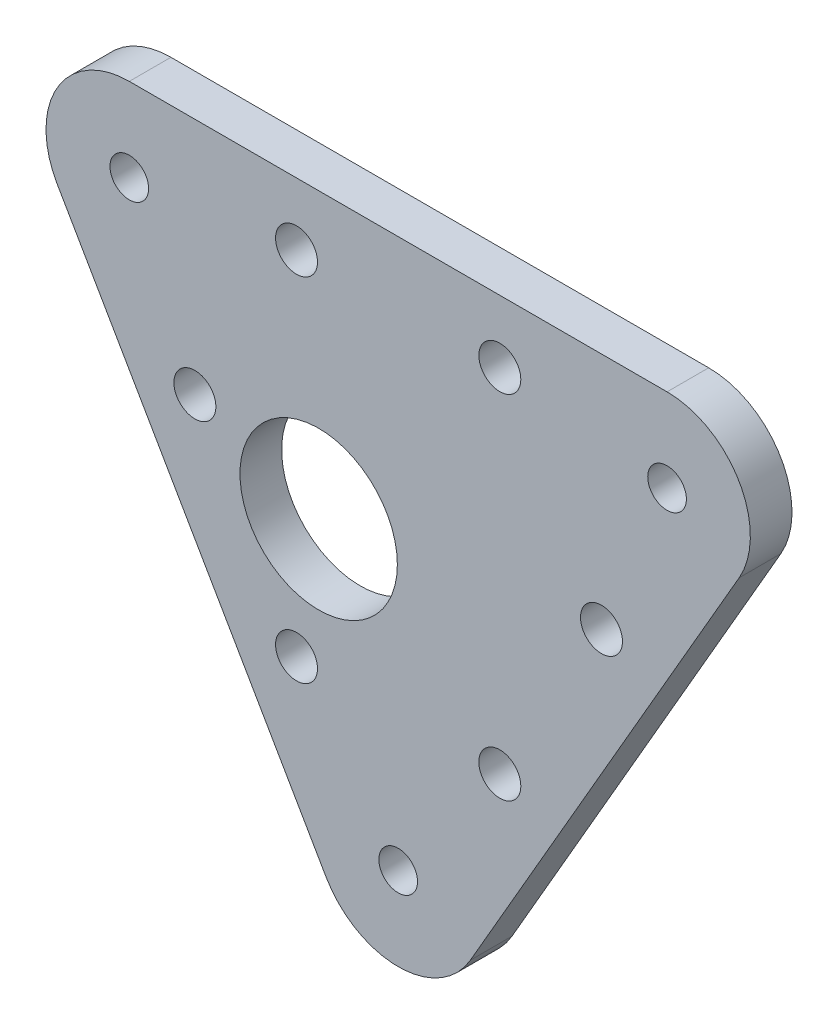
ISO-10303-21;
HEADER;
FILE_DESCRIPTION(('STEP AP214'),'2;1');
FILE_NAME('part.step','',(''),(''),'','','');
FILE_SCHEMA(('AUTOMOTIVE_DESIGN { 1 0 10303 214 1 1 1 1 }'));
ENDSEC;
DATA;
#1=APPLICATION_CONTEXT('core data for automotive mechanical design processes');
#2=APPLICATION_PROTOCOL_DEFINITION('international standard','automotive_design',2000,#1);
#3=PRODUCT_CONTEXT('',#1,'mechanical');
#4=PRODUCT('Part','Part','',(#3));
#5=PRODUCT_RELATED_PRODUCT_CATEGORY('part','',(#4));
#6=PRODUCT_DEFINITION_FORMATION('','',#4);
#7=PRODUCT_DEFINITION_CONTEXT('part definition',#1,'design');
#8=PRODUCT_DEFINITION('design','',#6,#7);
#9=PRODUCT_DEFINITION_SHAPE('','',#8);
#10=(LENGTH_UNIT() NAMED_UNIT(*) SI_UNIT(.MILLI.,.METRE.));
#11=(NAMED_UNIT(*) PLANE_ANGLE_UNIT() SI_UNIT($,.RADIAN.));
#12=(NAMED_UNIT(*) SI_UNIT($,.STERADIAN.) SOLID_ANGLE_UNIT());
#13=UNCERTAINTY_MEASURE_WITH_UNIT(LENGTH_MEASURE(1.E-05),#10,'distance_accuracy_value','');
#14=(GEOMETRIC_REPRESENTATION_CONTEXT(3) GLOBAL_UNCERTAINTY_ASSIGNED_CONTEXT((#13)) GLOBAL_UNIT_ASSIGNED_CONTEXT((#10,
#11,#12)) REPRESENTATION_CONTEXT('',''));
#15=CARTESIAN_POINT('',(0.,0.,0.));
#16=DIRECTION('',(0.,0.,1.));
#17=DIRECTION('',(1.,0.,0.));
#18=AXIS2_PLACEMENT_3D('',#15,#16,#17);
#19=CARTESIAN_POINT('',(31.4988919710468,18.1858937586588,-3.175));
#20=DIRECTION('',(0.,0.,1.));
#21=DIRECTION('',(-1.,0.,0.));
#22=AXIS2_PLACEMENT_3D('',#19,#20,#21);
#23=PLANE('',#22);
#24=CARTESIAN_POINT('',(-20.5003693429844,11.8358937586588,-3.175));
#25=DIRECTION('',(0.,0.,1.));
#26=DIRECTION('',(1.,0.,0.));
#27=AXIS2_PLACEMENT_3D('',#24,#25,#26);
#28=CIRCLE('',#27,1.47319999999999);
#29=CARTESIAN_POINT('',(-19.0271693429844,11.8358937586588,-3.175));
#30=VERTEX_POINT('',#29);
#31=EDGE_CURVE('E150',#30,#30,#28,.T.);
#32=ORIENTED_EDGE('',*,*,#31,.T.);
#33=EDGE_LOOP('',(#32));
#34=FACE_BOUND('',#33,.T.);
#35=CARTESIAN_POINT('',(20.5003693429844,11.8358937586588,-3.175));
#36=DIRECTION('',(0.,0.,1.));
#37=DIRECTION('',(1.,0.,0.));
#38=AXIS2_PLACEMENT_3D('',#35,#36,#37);
#39=CIRCLE('',#38,1.47319999999999);
#40=CARTESIAN_POINT('',(21.9735693429844,11.8358937586588,-3.175));
#41=VERTEX_POINT('',#40);
#42=EDGE_CURVE('E140',#41,#41,#39,.T.);
#43=ORIENTED_EDGE('',*,*,#42,.T.);
#44=EDGE_LOOP('',(#43));
#45=FACE_BOUND('',#44,.T.);
#46=CARTESIAN_POINT('',(-1.70002900645727E-13,-23.6717875173176,-3.175));
#47=DIRECTION('',(0.,0.,1.));
#48=DIRECTION('',(1.,0.,0.));
#49=AXIS2_PLACEMENT_3D('',#46,#47,#48);
#50=CIRCLE('',#49,1.47319999999999);
#51=CARTESIAN_POINT('',(1.47319999999982,-23.6717875173176,-3.175));
#52=VERTEX_POINT('',#51);
#53=EDGE_CURVE('E137',#52,#52,#50,.T.);
#54=ORIENTED_EDGE('',*,*,#53,.T.);
#55=EDGE_LOOP('',(#54));
#56=FACE_BOUND('',#55,.T.);
#57=CARTESIAN_POINT('',(-7.74999999999992,13.4233937586588,-3.175));
#58=DIRECTION('',(0.,0.,1.));
#59=DIRECTION('',(1.,0.,0.));
#60=AXIS2_PLACEMENT_3D('',#57,#58,#59);
#61=CIRCLE('',#60,1.59999999999999);
#62=CARTESIAN_POINT('',(-6.14999999999993,13.4233937586588,-3.175));
#63=VERTEX_POINT('',#62);
#64=EDGE_CURVE('E136',#63,#63,#61,.T.);
#65=ORIENTED_EDGE('',*,*,#64,.T.);
#66=EDGE_LOOP('',(#65));
#67=FACE_BOUND('',#66,.T.);
#68=CARTESIAN_POINT('',(7.75000000000008,13.4233937586588,-3.175));
#69=DIRECTION('',(0.,0.,1.));
#70=DIRECTION('',(1.,0.,0.));
#71=AXIS2_PLACEMENT_3D('',#68,#69,#70);
#72=CIRCLE('',#71,1.59999999999999);
#73=CARTESIAN_POINT('',(9.35000000000007,13.4233937586588,-3.175));
#74=VERTEX_POINT('',#73);
#75=EDGE_CURVE('E158',#74,#74,#72,.T.);
#76=ORIENTED_EDGE('',*,*,#75,.T.);
#77=EDGE_LOOP('',(#76));
#78=FACE_BOUND('',#77,.T.);
#79=CARTESIAN_POINT('',(15.5,0.,-3.175));
#80=DIRECTION('',(0.,0.,1.));
#81=DIRECTION('',(1.,0.,0.));
#82=AXIS2_PLACEMENT_3D('',#79,#80,#81);
#83=CIRCLE('',#82,1.59999999999999);
#84=CARTESIAN_POINT('',(17.1,0.,-3.175));
#85=VERTEX_POINT('',#84);
#86=EDGE_CURVE('E164',#85,#85,#83,.T.);
#87=ORIENTED_EDGE('',*,*,#86,.T.);
#88=EDGE_LOOP('',(#87));
#89=FACE_BOUND('',#88,.T.);
#90=CARTESIAN_POINT('',(-15.5,0.,-3.175));
#91=DIRECTION('',(0.,0.,1.));
#92=DIRECTION('',(1.,0.,0.));
#93=AXIS2_PLACEMENT_3D('',#90,#91,#92);
#94=CIRCLE('',#93,1.59999999999999);
#95=CARTESIAN_POINT('',(-13.9,0.,-3.175));
#96=VERTEX_POINT('',#95);
#97=EDGE_CURVE('E170',#96,#96,#94,.T.);
#98=ORIENTED_EDGE('',*,*,#97,.T.);
#99=EDGE_LOOP('',(#98));
#100=FACE_BOUND('',#99,.T.);
#101=CARTESIAN_POINT('',(-7.75000000000008,-13.4233937586588,-3.175));
#102=DIRECTION('',(0.,0.,1.));
#103=DIRECTION('',(1.,0.,0.));
#104=AXIS2_PLACEMENT_3D('',#101,#102,#103);
#105=CIRCLE('',#104,1.59999999999999);
#106=CARTESIAN_POINT('',(-6.1500000000001,-13.4233937586588,-3.175));
#107=VERTEX_POINT('',#106);
#108=EDGE_CURVE('E176',#107,#107,#105,.T.);
#109=ORIENTED_EDGE('',*,*,#108,.T.);
#110=EDGE_LOOP('',(#109));
#111=FACE_BOUND('',#110,.T.);
#112=CARTESIAN_POINT('',(7.74999999999992,-13.4233937586588,-3.175));
#113=DIRECTION('',(0.,0.,1.));
#114=DIRECTION('',(1.,0.,0.));
#115=AXIS2_PLACEMENT_3D('',#112,#113,#114);
#116=CIRCLE('',#115,1.59999999999999);
#117=CARTESIAN_POINT('',(9.34999999999991,-13.4233937586588,-3.175));
#118=VERTEX_POINT('',#117);
#119=EDGE_CURVE('E182',#118,#118,#116,.T.);
#120=ORIENTED_EDGE('',*,*,#119,.T.);
#121=EDGE_LOOP('',(#120));
#122=FACE_BOUND('',#121,.T.);
#123=DIRECTION('',(0.499999999999997,-0.86602540378444,0.));
#124=VECTOR('',#123,1.);
#125=CARTESIAN_POINT('',(-31.4988919710467,18.1858937586588,-3.175));
#126=LINE('',#125,#124);
#127=CARTESIAN_POINT('',(-25.9996306570156,8.66089375865878,-3.175));
#128=VERTEX_POINT('',#127);
#129=CARTESIAN_POINT('',(-5.49926131403138,-26.8467875173176,-3.175));
#130=VERTEX_POINT('',#129);
#131=EDGE_CURVE('E115',#128,#130,#126,.T.);
#132=ORIENTED_EDGE('',*,*,#131,.F.);
#133=CARTESIAN_POINT('',(-20.5003693429844,11.8358937586588,-3.175));
#134=DIRECTION('',(0.,0.,-1.));
#135=DIRECTION('',(-1.,0.,0.));
#136=AXIS2_PLACEMENT_3D('',#133,#134,#135);
#137=CIRCLE('',#136,6.35);
#138=CARTESIAN_POINT('',(-20.5003693429844,18.1858937586588,-3.175));
#139=VERTEX_POINT('',#138);
#140=EDGE_CURVE('E128',#139,#128,#137,.F.);
#141=ORIENTED_EDGE('',*,*,#140,.F.);
#142=DIRECTION('',(-1.,0.,0.));
#143=VECTOR('',#142,1.);
#144=CARTESIAN_POINT('',(-31.4988919710467,18.1858937586588,-3.175));
#145=LINE('',#144,#143);
#146=CARTESIAN_POINT('',(20.5003693429844,18.1858937586588,-3.175));
#147=VERTEX_POINT('',#146);
#148=EDGE_CURVE('E113',#147,#139,#145,.T.);
#149=ORIENTED_EDGE('',*,*,#148,.F.);
#150=CARTESIAN_POINT('',(20.5003693429844,11.8358937586588,-3.175));
#151=DIRECTION('',(0.,0.,-1.));
#152=DIRECTION('',(-1.,0.,0.));
#153=AXIS2_PLACEMENT_3D('',#150,#151,#152);
#154=CIRCLE('',#153,6.35);
#155=CARTESIAN_POINT('',(25.9996306570155,8.66089375865874,-3.175));
#156=VERTEX_POINT('',#155);
#157=EDGE_CURVE('E130',#156,#147,#154,.F.);
#158=ORIENTED_EDGE('',*,*,#157,.F.);
#159=DIRECTION('',(0.500000000000003,0.866025403784437,0.));
#160=VECTOR('',#159,1.);
#161=CARTESIAN_POINT('',(31.4988919710468,18.1858937586588,-3.175));
#162=LINE('',#161,#160);
#163=CARTESIAN_POINT('',(5.49926131403101,-26.8467875173176,-3.175));
#164=VERTEX_POINT('',#163);
#165=EDGE_CURVE('E121',#164,#156,#162,.T.);
#166=ORIENTED_EDGE('',*,*,#165,.F.);
#167=CARTESIAN_POINT('',(-1.70002900645727E-13,-23.6717875173176,-3.175));
#168=DIRECTION('',(0.,0.,-1.));
#169=DIRECTION('',(-1.,0.,0.));
#170=AXIS2_PLACEMENT_3D('',#167,#168,#169);
#171=CIRCLE('',#170,6.35);
#172=EDGE_CURVE('E91',#130,#164,#171,.F.);
#173=ORIENTED_EDGE('',*,*,#172,.F.);
#174=EDGE_LOOP('',(#132,#141,#149,#158,#166,#173));
#175=FACE_BOUND('',#174,.T.);
#176=CARTESIAN_POINT('',(-6.06217782649109,-3.49999999999996,-3.175));
#177=DIRECTION('',(0.,0.,1.));
#178=DIRECTION('',(1.,0.,0.));
#179=AXIS2_PLACEMENT_3D('',#176,#177,#178);
#180=CIRCLE('',#179,6.);
#181=CARTESIAN_POINT('',(-0.0621778264910892,-3.49999999999996,-3.175));
#182=VERTEX_POINT('',#181);
#183=EDGE_CURVE('E189',#182,#182,#180,.T.);
#184=ORIENTED_EDGE('',*,*,#183,.T.);
#185=EDGE_LOOP('',(#184));
#186=FACE_BOUND('',#185,.T.);
#187=ADVANCED_FACE('F32',(#34,#45,#56,#67,#78,#89,#100,#111,#122,#175,#186),#23,.F.);
#188=CARTESIAN_POINT('',(31.4988919710468,18.1858937586588,0.));
#189=DIRECTION('',(0.,0.,1.));
#190=DIRECTION('',(-1.,0.,0.));
#191=AXIS2_PLACEMENT_3D('',#188,#189,#190);
#192=PLANE('',#191);
#193=CARTESIAN_POINT('',(-20.5003693429844,11.8358937586588,0.));
#194=DIRECTION('',(0.,0.,-1.));
#195=DIRECTION('',(-1.,0.,0.));
#196=AXIS2_PLACEMENT_3D('',#193,#194,#195);
#197=CIRCLE('',#196,1.47319999999999);
#198=CARTESIAN_POINT('',(-21.9735693429844,11.8358937586588,0.));
#199=VERTEX_POINT('',#198);
#200=EDGE_CURVE('E36',#199,#199,#197,.T.);
#201=ORIENTED_EDGE('',*,*,#200,.T.);
#202=EDGE_LOOP('',(#201));
#203=FACE_BOUND('',#202,.T.);
#204=CARTESIAN_POINT('',(20.5003693429844,11.8358937586588,0.));
#205=DIRECTION('',(0.,0.,-1.));
#206=DIRECTION('',(-1.,0.,0.));
#207=AXIS2_PLACEMENT_3D('',#204,#205,#206);
#208=CIRCLE('',#207,1.47319999999999);
#209=CARTESIAN_POINT('',(19.0271693429844,11.8358937586588,0.));
#210=VERTEX_POINT('',#209);
#211=EDGE_CURVE('E138',#210,#210,#208,.T.);
#212=ORIENTED_EDGE('',*,*,#211,.T.);
#213=EDGE_LOOP('',(#212));
#214=FACE_BOUND('',#213,.T.);
#215=CARTESIAN_POINT('',(-1.70002900645727E-13,-23.6717875173176,0.));
#216=DIRECTION('',(0.,0.,-1.));
#217=DIRECTION('',(-1.,0.,0.));
#218=AXIS2_PLACEMENT_3D('',#215,#216,#217);
#219=CIRCLE('',#218,1.47319999999999);
#220=CARTESIAN_POINT('',(-1.47320000000016,-23.6717875173176,0.));
#221=VERTEX_POINT('',#220);
#222=EDGE_CURVE('E134',#221,#221,#219,.T.);
#223=ORIENTED_EDGE('',*,*,#222,.T.);
#224=EDGE_LOOP('',(#223));
#225=FACE_BOUND('',#224,.T.);
#226=CARTESIAN_POINT('',(-7.74999999999992,13.4233937586588,-1.18221404887819E-12));
#227=DIRECTION('',(0.,0.,1.));
#228=DIRECTION('',(1.,0.,0.));
#229=AXIS2_PLACEMENT_3D('',#226,#227,#228);
#230=CIRCLE('',#229,1.6);
#231=CARTESIAN_POINT('',(-6.14999999999992,13.4233937586588,-1.18221404887819E-12));
#232=VERTEX_POINT('',#231);
#233=EDGE_CURVE('E155',#232,#232,#230,.T.);
#234=ORIENTED_EDGE('',*,*,#233,.F.);
#235=EDGE_LOOP('',(#234));
#236=FACE_BOUND('',#235,.T.);
#237=CARTESIAN_POINT('',(7.75000000000008,13.4233937586588,-1.18221404887819E-12));
#238=DIRECTION('',(0.,0.,1.));
#239=DIRECTION('',(1.,0.,0.));
#240=AXIS2_PLACEMENT_3D('',#237,#238,#239);
#241=CIRCLE('',#240,1.6);
#242=CARTESIAN_POINT('',(9.35000000000008,13.4233937586588,-1.18221404887819E-12));
#243=VERTEX_POINT('',#242);
#244=EDGE_CURVE('E161',#243,#243,#241,.T.);
#245=ORIENTED_EDGE('',*,*,#244,.F.);
#246=EDGE_LOOP('',(#245));
#247=FACE_BOUND('',#246,.T.);
#248=CARTESIAN_POINT('',(15.5,0.,-1.18221404887819E-12));
#249=DIRECTION('',(0.,0.,1.));
#250=DIRECTION('',(1.,0.,0.));
#251=AXIS2_PLACEMENT_3D('',#248,#249,#250);
#252=CIRCLE('',#251,1.6);
#253=CARTESIAN_POINT('',(17.1,0.,-1.18221404887819E-12));
#254=VERTEX_POINT('',#253);
#255=EDGE_CURVE('E167',#254,#254,#252,.T.);
#256=ORIENTED_EDGE('',*,*,#255,.F.);
#257=EDGE_LOOP('',(#256));
#258=FACE_BOUND('',#257,.T.);
#259=CARTESIAN_POINT('',(-15.5,0.,-1.18221404887819E-12));
#260=DIRECTION('',(0.,0.,1.));
#261=DIRECTION('',(1.,0.,0.));
#262=AXIS2_PLACEMENT_3D('',#259,#260,#261);
#263=CIRCLE('',#262,1.6);
#264=CARTESIAN_POINT('',(-13.9,0.,-1.18221404887819E-12));
#265=VERTEX_POINT('',#264);
#266=EDGE_CURVE('E173',#265,#265,#263,.T.);
#267=ORIENTED_EDGE('',*,*,#266,.F.);
#268=EDGE_LOOP('',(#267));
#269=FACE_BOUND('',#268,.T.);
#270=CARTESIAN_POINT('',(-7.75000000000008,-13.4233937586588,-1.18221404887819E-12));
#271=DIRECTION('',(0.,0.,1.));
#272=DIRECTION('',(1.,0.,0.));
#273=AXIS2_PLACEMENT_3D('',#270,#271,#272);
#274=CIRCLE('',#273,1.6);
#275=CARTESIAN_POINT('',(-6.15000000000008,-13.4233937586588,-1.18221404887819E-12));
#276=VERTEX_POINT('',#275);
#277=EDGE_CURVE('E179',#276,#276,#274,.T.);
#278=ORIENTED_EDGE('',*,*,#277,.F.);
#279=EDGE_LOOP('',(#278));
#280=FACE_BOUND('',#279,.T.);
#281=CARTESIAN_POINT('',(7.74999999999992,-13.4233937586588,-1.18221404887819E-12));
#282=DIRECTION('',(0.,0.,1.));
#283=DIRECTION('',(1.,0.,0.));
#284=AXIS2_PLACEMENT_3D('',#281,#282,#283);
#285=CIRCLE('',#284,1.6);
#286=CARTESIAN_POINT('',(9.34999999999992,-13.4233937586588,-1.18221404887819E-12));
#287=VERTEX_POINT('',#286);
#288=EDGE_CURVE('E185',#287,#287,#285,.T.);
#289=ORIENTED_EDGE('',*,*,#288,.F.);
#290=EDGE_LOOP('',(#289));
#291=FACE_BOUND('',#290,.T.);
#292=DIRECTION('',(0.500000000000003,0.866025403784437,0.));
#293=VECTOR('',#292,1.);
#294=CARTESIAN_POINT('',(31.4988919710468,18.1858937586588,0.));
#295=LINE('',#294,#293);
#296=CARTESIAN_POINT('',(5.49926131403101,-26.8467875173176,0.));
#297=VERTEX_POINT('',#296);
#298=CARTESIAN_POINT('',(25.9996306570155,8.66089375865874,0.));
#299=VERTEX_POINT('',#298);
#300=EDGE_CURVE('E104',#297,#299,#295,.T.);
#301=ORIENTED_EDGE('',*,*,#300,.T.);
#302=CARTESIAN_POINT('',(20.5003693429844,11.8358937586588,0.));
#303=DIRECTION('',(0.,0.,-1.));
#304=DIRECTION('',(-1.,0.,0.));
#305=AXIS2_PLACEMENT_3D('',#302,#303,#304);
#306=CIRCLE('',#305,6.35);
#307=CARTESIAN_POINT('',(20.5003693429844,18.1858937586588,0.));
#308=VERTEX_POINT('',#307);
#309=EDGE_CURVE('E109',#308,#299,#306,.T.);
#310=ORIENTED_EDGE('',*,*,#309,.F.);
#311=DIRECTION('',(-1.,0.,0.));
#312=VECTOR('',#311,1.);
#313=CARTESIAN_POINT('',(-31.4988919710467,18.1858937586588,0.));
#314=LINE('',#313,#312);
#315=CARTESIAN_POINT('',(-20.5003693429844,18.1858937586588,0.));
#316=VERTEX_POINT('',#315);
#317=EDGE_CURVE('E117',#308,#316,#314,.T.);
#318=ORIENTED_EDGE('',*,*,#317,.T.);
#319=CARTESIAN_POINT('',(-20.5003693429844,11.8358937586588,0.));
#320=DIRECTION('',(0.,0.,-1.));
#321=DIRECTION('',(-1.,0.,0.));
#322=AXIS2_PLACEMENT_3D('',#319,#320,#321);
#323=CIRCLE('',#322,6.35);
#324=CARTESIAN_POINT('',(-25.9996306570156,8.66089375865878,0.));
#325=VERTEX_POINT('',#324);
#326=EDGE_CURVE('E96',#325,#316,#323,.T.);
#327=ORIENTED_EDGE('',*,*,#326,.F.);
#328=DIRECTION('',(0.499999999999997,-0.86602540378444,0.));
#329=VECTOR('',#328,1.);
#330=CARTESIAN_POINT('',(-31.4988919710467,18.1858937586588,0.));
#331=LINE('',#330,#329);
#332=CARTESIAN_POINT('',(-5.49926131403138,-26.8467875173176,0.));
#333=VERTEX_POINT('',#332);
#334=EDGE_CURVE('E107',#325,#333,#331,.T.);
#335=ORIENTED_EDGE('',*,*,#334,.T.);
#336=CARTESIAN_POINT('',(-1.70002900645727E-13,-23.6717875173176,0.));
#337=DIRECTION('',(0.,0.,-1.));
#338=DIRECTION('',(-1.,0.,0.));
#339=AXIS2_PLACEMENT_3D('',#336,#337,#338);
#340=CIRCLE('',#339,6.35);
#341=EDGE_CURVE('E88',#297,#333,#340,.T.);
#342=ORIENTED_EDGE('',*,*,#341,.F.);
#343=EDGE_LOOP('',(#301,#310,#318,#327,#335,#342));
#344=FACE_BOUND('',#343,.T.);
#345=CARTESIAN_POINT('',(-6.06217782649109,-3.49999999999996,0.));
#346=DIRECTION('',(0.,0.,1.));
#347=DIRECTION('',(1.,0.,0.));
#348=AXIS2_PLACEMENT_3D('',#345,#346,#347);
#349=CIRCLE('',#348,6.);
#350=CARTESIAN_POINT('',(-0.0621778264910892,-3.49999999999996,0.));
#351=VERTEX_POINT('',#350);
#352=EDGE_CURVE('E188',#351,#351,#349,.T.);
#353=ORIENTED_EDGE('',*,*,#352,.F.);
#354=EDGE_LOOP('',(#353));
#355=FACE_BOUND('',#354,.T.);
#356=ADVANCED_FACE('F101',(#203,#214,#225,#236,#247,#258,#269,#280,#291,#344,#355),#192,.T.);
#357=CARTESIAN_POINT('',(-31.4988919710467,18.1858937586588,-3.175));
#358=DIRECTION('',(0.,-1.,0.));
#359=DIRECTION('',(0.,0.,1.));
#360=AXIS2_PLACEMENT_3D('',#357,#358,#359);
#361=PLANE('',#360);
#362=ORIENTED_EDGE('',*,*,#148,.T.);
#363=DIRECTION('',(0.,0.,1.));
#364=VECTOR('',#363,1.);
#365=CARTESIAN_POINT('',(-20.5003693429844,18.1858937586588,-3.175));
#366=LINE('',#365,#364);
#367=EDGE_CURVE('E41',#316,#139,#366,.F.);
#368=ORIENTED_EDGE('',*,*,#367,.F.);
#369=ORIENTED_EDGE('',*,*,#317,.F.);
#370=DIRECTION('',(0.,0.,1.));
#371=VECTOR('',#370,1.);
#372=CARTESIAN_POINT('',(20.5003693429844,18.1858937586588,-3.175));
#373=LINE('',#372,#371);
#374=EDGE_CURVE('E11',#147,#308,#373,.T.);
#375=ORIENTED_EDGE('',*,*,#374,.F.);
#376=EDGE_LOOP('',(#362,#368,#369,#375));
#377=FACE_BOUND('',#376,.T.);
#378=ADVANCED_FACE('F197',(#377),#361,.F.);
#379=CARTESIAN_POINT('',(-31.4988919710467,18.1858937586588,-3.175));
#380=DIRECTION('',(0.866025403784441,0.499999999999997,0.));
#381=DIRECTION('',(-0.499999999999997,0.86602540378444,0.));
#382=AXIS2_PLACEMENT_3D('',#379,#380,#381);
#383=PLANE('',#382);
#384=ORIENTED_EDGE('',*,*,#334,.F.);
#385=DIRECTION('',(0.,0.,1.));
#386=VECTOR('',#385,1.);
#387=CARTESIAN_POINT('',(-25.9996306570156,8.66089375865878,-3.175));
#388=LINE('',#387,#386);
#389=EDGE_CURVE('E108',#128,#325,#388,.T.);
#390=ORIENTED_EDGE('',*,*,#389,.F.);
#391=ORIENTED_EDGE('',*,*,#131,.T.);
#392=DIRECTION('',(0.,0.,1.));
#393=VECTOR('',#392,1.);
#394=CARTESIAN_POINT('',(-5.49926131403136,-26.8467875173176,-3.175));
#395=LINE('',#394,#393);
#396=EDGE_CURVE('E126',#333,#130,#395,.F.);
#397=ORIENTED_EDGE('',*,*,#396,.F.);
#398=EDGE_LOOP('',(#384,#390,#391,#397));
#399=FACE_BOUND('',#398,.T.);
#400=ADVANCED_FACE('F202',(#399),#383,.F.);
#401=CARTESIAN_POINT('',(31.4988919710468,18.1858937586588,-3.175));
#402=DIRECTION('',(-0.866025403784437,0.500000000000003,0.));
#403=DIRECTION('',(-0.500000000000003,-0.866025403784437,0.));
#404=AXIS2_PLACEMENT_3D('',#401,#402,#403);
#405=PLANE('',#404);
#406=ORIENTED_EDGE('',*,*,#165,.T.);
#407=DIRECTION('',(0.,0.,1.));
#408=VECTOR('',#407,1.);
#409=CARTESIAN_POINT('',(25.9996306570155,8.66089375865874,-3.175));
#410=LINE('',#409,#408);
#411=EDGE_CURVE('E97',#299,#156,#410,.F.);
#412=ORIENTED_EDGE('',*,*,#411,.F.);
#413=ORIENTED_EDGE('',*,*,#300,.F.);
#414=DIRECTION('',(0.,0.,1.));
#415=VECTOR('',#414,1.);
#416=CARTESIAN_POINT('',(5.49926131403101,-26.8467875173176,-3.175));
#417=LINE('',#416,#415);
#418=EDGE_CURVE('E85',#164,#297,#417,.T.);
#419=ORIENTED_EDGE('',*,*,#418,.F.);
#420=EDGE_LOOP('',(#406,#412,#413,#419));
#421=FACE_BOUND('',#420,.T.);
#422=ADVANCED_FACE('F111',(#421),#405,.F.);
#423=CARTESIAN_POINT('',(-6.06217782649109,-3.49999999999996,-3.175));
#424=DIRECTION('',(0.,0.,1.));
#425=DIRECTION('',(-1.,0.,0.));
#426=AXIS2_PLACEMENT_3D('',#423,#424,#425);
#427=CYLINDRICAL_SURFACE('',#426,6.);
#428=ORIENTED_EDGE('',*,*,#183,.F.);
#429=EDGE_LOOP('',(#428));
#430=FACE_BOUND('',#429,.T.);
#431=ORIENTED_EDGE('',*,*,#352,.T.);
#432=EDGE_LOOP('',(#431));
#433=FACE_BOUND('',#432,.T.);
#434=ADVANCED_FACE('F226',(#430,#433),#427,.F.);
#435=CARTESIAN_POINT('',(7.74999999999992,-13.4233937586588,-3.175));
#436=DIRECTION('',(0.,0.,-1.));
#437=DIRECTION('',(1.,0.,0.));
#438=AXIS2_PLACEMENT_3D('',#435,#436,#437);
#439=CYLINDRICAL_SURFACE('',#438,1.59999999999999);
#440=ORIENTED_EDGE('',*,*,#288,.T.);
#441=EDGE_LOOP('',(#440));
#442=FACE_BOUND('',#441,.T.);
#443=ORIENTED_EDGE('',*,*,#119,.F.);
#444=EDGE_LOOP('',(#443));
#445=FACE_BOUND('',#444,.T.);
#446=ADVANCED_FACE('F252',(#442,#445),#439,.F.);
#447=CARTESIAN_POINT('',(-7.75000000000008,-13.4233937586588,-3.175));
#448=DIRECTION('',(0.,0.,-1.));
#449=DIRECTION('',(1.,0.,0.));
#450=AXIS2_PLACEMENT_3D('',#447,#448,#449);
#451=CYLINDRICAL_SURFACE('',#450,1.59999999999999);
#452=ORIENTED_EDGE('',*,*,#277,.T.);
#453=EDGE_LOOP('',(#452));
#454=FACE_BOUND('',#453,.T.);
#455=ORIENTED_EDGE('',*,*,#108,.F.);
#456=EDGE_LOOP('',(#455));
#457=FACE_BOUND('',#456,.T.);
#458=ADVANCED_FACE('F259',(#454,#457),#451,.F.);
#459=CARTESIAN_POINT('',(-15.5,0.,-3.175));
#460=DIRECTION('',(0.,0.,-1.));
#461=DIRECTION('',(1.,0.,0.));
#462=AXIS2_PLACEMENT_3D('',#459,#460,#461);
#463=CYLINDRICAL_SURFACE('',#462,1.59999999999999);
#464=ORIENTED_EDGE('',*,*,#266,.T.);
#465=EDGE_LOOP('',(#464));
#466=FACE_BOUND('',#465,.T.);
#467=ORIENTED_EDGE('',*,*,#97,.F.);
#468=EDGE_LOOP('',(#467));
#469=FACE_BOUND('',#468,.T.);
#470=ADVANCED_FACE('F266',(#466,#469),#463,.F.);
#471=CARTESIAN_POINT('',(15.5,0.,-3.175));
#472=DIRECTION('',(0.,0.,-1.));
#473=DIRECTION('',(1.,0.,0.));
#474=AXIS2_PLACEMENT_3D('',#471,#472,#473);
#475=CYLINDRICAL_SURFACE('',#474,1.59999999999999);
#476=ORIENTED_EDGE('',*,*,#255,.T.);
#477=EDGE_LOOP('',(#476));
#478=FACE_BOUND('',#477,.T.);
#479=ORIENTED_EDGE('',*,*,#86,.F.);
#480=EDGE_LOOP('',(#479));
#481=FACE_BOUND('',#480,.T.);
#482=ADVANCED_FACE('F274',(#478,#481),#475,.F.);
#483=CARTESIAN_POINT('',(7.75000000000008,13.4233937586588,-3.175));
#484=DIRECTION('',(0.,0.,-1.));
#485=DIRECTION('',(1.,0.,0.));
#486=AXIS2_PLACEMENT_3D('',#483,#484,#485);
#487=CYLINDRICAL_SURFACE('',#486,1.59999999999999);
#488=ORIENTED_EDGE('',*,*,#244,.T.);
#489=EDGE_LOOP('',(#488));
#490=FACE_BOUND('',#489,.T.);
#491=ORIENTED_EDGE('',*,*,#75,.F.);
#492=EDGE_LOOP('',(#491));
#493=FACE_BOUND('',#492,.T.);
#494=ADVANCED_FACE('F282',(#490,#493),#487,.F.);
#495=CARTESIAN_POINT('',(-7.74999999999992,13.4233937586588,-3.175));
#496=DIRECTION('',(0.,0.,-1.));
#497=DIRECTION('',(1.,0.,0.));
#498=AXIS2_PLACEMENT_3D('',#495,#496,#497);
#499=CYLINDRICAL_SURFACE('',#498,1.59999999999999);
#500=ORIENTED_EDGE('',*,*,#233,.T.);
#501=EDGE_LOOP('',(#500));
#502=FACE_BOUND('',#501,.T.);
#503=ORIENTED_EDGE('',*,*,#64,.F.);
#504=EDGE_LOOP('',(#503));
#505=FACE_BOUND('',#504,.T.);
#506=ADVANCED_FACE('F214',(#502,#505),#499,.F.);
#507=CARTESIAN_POINT('',(-1.70002900645727E-13,-23.6717875173176,-3.175));
#508=DIRECTION('',(0.,0.,1.));
#509=DIRECTION('',(-1.,0.,0.));
#510=AXIS2_PLACEMENT_3D('',#507,#508,#509);
#511=CYLINDRICAL_SURFACE('',#510,6.35);
#512=ORIENTED_EDGE('',*,*,#172,.T.);
#513=ORIENTED_EDGE('',*,*,#418,.T.);
#514=ORIENTED_EDGE('',*,*,#341,.T.);
#515=ORIENTED_EDGE('',*,*,#396,.T.);
#516=EDGE_LOOP('',(#512,#513,#514,#515));
#517=FACE_BOUND('',#516,.T.);
#518=ADVANCED_FACE('F87',(#517),#511,.T.);
#519=CARTESIAN_POINT('',(20.5003693429844,11.8358937586588,-3.175));
#520=DIRECTION('',(0.,0.,1.));
#521=DIRECTION('',(-1.,0.,0.));
#522=AXIS2_PLACEMENT_3D('',#519,#520,#521);
#523=CYLINDRICAL_SURFACE('',#522,6.35);
#524=ORIENTED_EDGE('',*,*,#157,.T.);
#525=ORIENTED_EDGE('',*,*,#374,.T.);
#526=ORIENTED_EDGE('',*,*,#309,.T.);
#527=ORIENTED_EDGE('',*,*,#411,.T.);
#528=EDGE_LOOP('',(#524,#525,#526,#527));
#529=FACE_BOUND('',#528,.T.);
#530=ADVANCED_FACE('F207',(#529),#523,.T.);
#531=CARTESIAN_POINT('',(-20.5003693429844,11.8358937586588,-3.175));
#532=DIRECTION('',(0.,0.,1.));
#533=DIRECTION('',(-1.,0.,0.));
#534=AXIS2_PLACEMENT_3D('',#531,#532,#533);
#535=CYLINDRICAL_SURFACE('',#534,6.35);
#536=ORIENTED_EDGE('',*,*,#140,.T.);
#537=ORIENTED_EDGE('',*,*,#389,.T.);
#538=ORIENTED_EDGE('',*,*,#326,.T.);
#539=ORIENTED_EDGE('',*,*,#367,.T.);
#540=EDGE_LOOP('',(#536,#537,#538,#539));
#541=FACE_BOUND('',#540,.T.);
#542=ADVANCED_FACE('F34',(#541),#535,.T.);
#543=CARTESIAN_POINT('',(-1.70002900645727E-13,-23.6717875173176,-3.175));
#544=DIRECTION('',(0.,0.,-1.));
#545=DIRECTION('',(1.,0.,0.));
#546=AXIS2_PLACEMENT_3D('',#543,#544,#545);
#547=CYLINDRICAL_SURFACE('',#546,1.47319999999999);
#548=ORIENTED_EDGE('',*,*,#222,.F.);
#549=EDGE_LOOP('',(#548));
#550=FACE_BOUND('',#549,.T.);
#551=ORIENTED_EDGE('',*,*,#53,.F.);
#552=EDGE_LOOP('',(#551));
#553=FACE_BOUND('',#552,.T.);
#554=ADVANCED_FACE('F213',(#550,#553),#547,.F.);
#555=CARTESIAN_POINT('',(20.5003693429844,11.8358937586588,-3.175));
#556=DIRECTION('',(0.,0.,-1.));
#557=DIRECTION('',(1.,0.,0.));
#558=AXIS2_PLACEMENT_3D('',#555,#556,#557);
#559=CYLINDRICAL_SURFACE('',#558,1.47319999999999);
#560=ORIENTED_EDGE('',*,*,#211,.F.);
#561=EDGE_LOOP('',(#560));
#562=FACE_BOUND('',#561,.T.);
#563=ORIENTED_EDGE('',*,*,#42,.F.);
#564=EDGE_LOOP('',(#563));
#565=FACE_BOUND('',#564,.T.);
#566=ADVANCED_FACE('F321',(#562,#565),#559,.F.);
#567=CARTESIAN_POINT('',(-20.5003693429844,11.8358937586588,-3.175));
#568=DIRECTION('',(0.,0.,-1.));
#569=DIRECTION('',(1.,0.,0.));
#570=AXIS2_PLACEMENT_3D('',#567,#568,#569);
#571=CYLINDRICAL_SURFACE('',#570,1.47319999999999);
#572=ORIENTED_EDGE('',*,*,#200,.F.);
#573=EDGE_LOOP('',(#572));
#574=FACE_BOUND('',#573,.T.);
#575=ORIENTED_EDGE('',*,*,#31,.F.);
#576=EDGE_LOOP('',(#575));
#577=FACE_BOUND('',#576,.T.);
#578=ADVANCED_FACE('F331',(#574,#577),#571,.F.);
#579=CLOSED_SHELL('',(#187,#356,#378,#400,#422,#434,#446,#458,#470,#482,#494,#506,#518,#530,
#542,#554,#566,#578));
#580=MANIFOLD_SOLID_BREP('B2',#579);
#581=ADVANCED_BREP_SHAPE_REPRESENTATION('',(#18,#580),#14);
#582=SHAPE_DEFINITION_REPRESENTATION(#9,#581);
ENDSEC;
END-ISO-10303-21;
